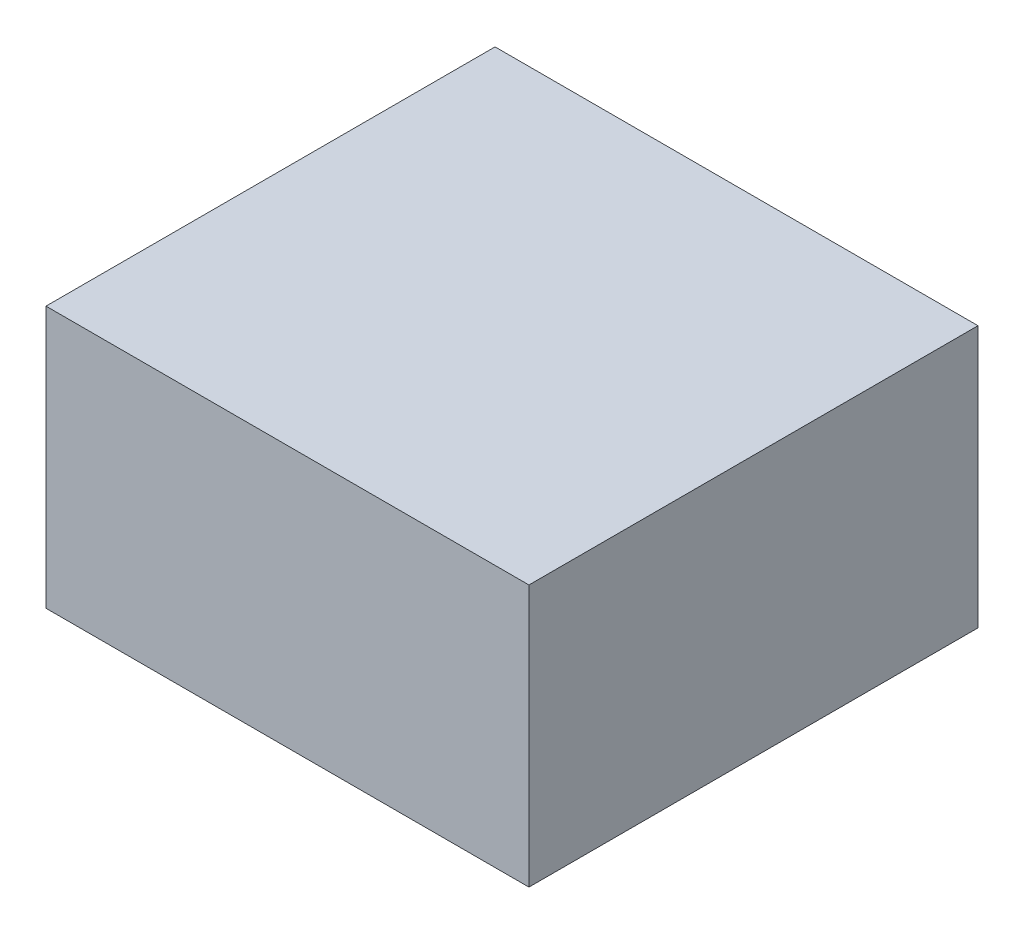
ISO-10303-21;
HEADER;
FILE_DESCRIPTION(('STEP AP214'),'2;1');
FILE_NAME('part.step','',(''),(''),'','','');
FILE_SCHEMA(('AUTOMOTIVE_DESIGN { 1 0 10303 214 1 1 1 1 }'));
ENDSEC;
DATA;
#1=APPLICATION_CONTEXT('core data for automotive mechanical design processes');
#2=APPLICATION_PROTOCOL_DEFINITION('international standard','automotive_design',2000,#1);
#3=PRODUCT_CONTEXT('',#1,'mechanical');
#4=PRODUCT('Part','Part','',(#3));
#5=PRODUCT_RELATED_PRODUCT_CATEGORY('part','',(#4));
#6=PRODUCT_DEFINITION_FORMATION('','',#4);
#7=PRODUCT_DEFINITION_CONTEXT('part definition',#1,'design');
#8=PRODUCT_DEFINITION('design','',#6,#7);
#9=PRODUCT_DEFINITION_SHAPE('','',#8);
#10=(LENGTH_UNIT() NAMED_UNIT(*) SI_UNIT(.MILLI.,.METRE.));
#11=(NAMED_UNIT(*) PLANE_ANGLE_UNIT() SI_UNIT($,.RADIAN.));
#12=(NAMED_UNIT(*) SI_UNIT($,.STERADIAN.) SOLID_ANGLE_UNIT());
#13=UNCERTAINTY_MEASURE_WITH_UNIT(LENGTH_MEASURE(1.E-05),#10,'distance_accuracy_value','');
#14=(GEOMETRIC_REPRESENTATION_CONTEXT(3) GLOBAL_UNCERTAINTY_ASSIGNED_CONTEXT((#13)) GLOBAL_UNIT_ASSIGNED_CONTEXT((#10,
#11,#12)) REPRESENTATION_CONTEXT('',''));
#15=CARTESIAN_POINT('',(0.,0.,0.));
#16=DIRECTION('',(0.,0.,1.));
#17=DIRECTION('',(1.,0.,0.));
#18=AXIS2_PLACEMENT_3D('',#15,#16,#17);
#19=CARTESIAN_POINT('',(0.,55.88,0.));
#20=DIRECTION('',(1.,0.,0.));
#21=DIRECTION('',(0.,0.,-1.));
#22=AXIS2_PLACEMENT_3D('',#19,#20,#21);
#23=PLANE('',#22);
#24=DIRECTION('',(0.,0.,1.));
#25=VECTOR('',#24,1.);
#26=CARTESIAN_POINT('',(0.,0.,0.));
#27=LINE('',#26,#25);
#28=CARTESIAN_POINT('',(0.,0.,0.));
#29=VERTEX_POINT('',#28);
#30=CARTESIAN_POINT('',(0.,0.,95.885));
#31=VERTEX_POINT('',#30);
#32=EDGE_CURVE('E75',#29,#31,#27,.T.);
#33=ORIENTED_EDGE('',*,*,#32,.T.);
#34=DIRECTION('',(0.,-1.,0.));
#35=VECTOR('',#34,1.);
#36=CARTESIAN_POINT('',(0.,55.88,95.885));
#37=LINE('',#36,#35);
#38=CARTESIAN_POINT('',(0.,55.88,95.885));
#39=VERTEX_POINT('',#38);
#40=EDGE_CURVE('E11',#39,#31,#37,.T.);
#41=ORIENTED_EDGE('',*,*,#40,.F.);
#42=DIRECTION('',(0.,0.,1.));
#43=VECTOR('',#42,1.);
#44=CARTESIAN_POINT('',(0.,55.88,0.));
#45=LINE('',#44,#43);
#46=CARTESIAN_POINT('',(0.,55.88,0.));
#47=VERTEX_POINT('',#46);
#48=EDGE_CURVE('E93',#47,#39,#45,.T.);
#49=ORIENTED_EDGE('',*,*,#48,.F.);
#50=DIRECTION('',(0.,-1.,0.));
#51=VECTOR('',#50,1.);
#52=CARTESIAN_POINT('',(0.,55.88,0.));
#53=LINE('',#52,#51);
#54=EDGE_CURVE('E87',#47,#29,#53,.T.);
#55=ORIENTED_EDGE('',*,*,#54,.T.);
#56=EDGE_LOOP('',(#33,#41,#49,#55));
#57=FACE_BOUND('',#56,.T.);
#58=ADVANCED_FACE('F31',(#57),#23,.F.);
#59=CARTESIAN_POINT('',(0.,55.88,95.885));
#60=DIRECTION('',(0.,0.,-1.));
#61=DIRECTION('',(-1.,0.,0.));
#62=AXIS2_PLACEMENT_3D('',#59,#60,#61);
#63=PLANE('',#62);
#64=DIRECTION('',(1.,0.,0.));
#65=VECTOR('',#64,1.);
#66=CARTESIAN_POINT('',(0.,0.,95.885));
#67=LINE('',#66,#65);
#68=CARTESIAN_POINT('',(103.124,0.,95.885));
#69=VERTEX_POINT('',#68);
#70=EDGE_CURVE('E71',#31,#69,#67,.T.);
#71=ORIENTED_EDGE('',*,*,#70,.T.);
#72=DIRECTION('',(0.,-1.,0.));
#73=VECTOR('',#72,1.);
#74=CARTESIAN_POINT('',(103.124,55.88,95.885));
#75=LINE('',#74,#73);
#76=CARTESIAN_POINT('',(103.124,55.88,95.885));
#77=VERTEX_POINT('',#76);
#78=EDGE_CURVE('E38',#77,#69,#75,.T.);
#79=ORIENTED_EDGE('',*,*,#78,.F.);
#80=DIRECTION('',(1.,0.,0.));
#81=VECTOR('',#80,1.);
#82=CARTESIAN_POINT('',(0.,55.88,95.885));
#83=LINE('',#82,#81);
#84=EDGE_CURVE('E83',#39,#77,#83,.T.);
#85=ORIENTED_EDGE('',*,*,#84,.F.);
#86=ORIENTED_EDGE('',*,*,#40,.T.);
#87=EDGE_LOOP('',(#71,#79,#85,#86));
#88=FACE_BOUND('',#87,.T.);
#89=ADVANCED_FACE('F82',(#88),#63,.F.);
#90=CARTESIAN_POINT('',(103.124,55.88,0.));
#91=DIRECTION('',(-1.,0.,0.));
#92=DIRECTION('',(0.,0.,1.));
#93=AXIS2_PLACEMENT_3D('',#90,#91,#92);
#94=PLANE('',#93);
#95=DIRECTION('',(0.,0.,-1.));
#96=VECTOR('',#95,1.);
#97=CARTESIAN_POINT('',(103.124,0.,0.));
#98=LINE('',#97,#96);
#99=CARTESIAN_POINT('',(103.124,0.,0.));
#100=VERTEX_POINT('',#99);
#101=EDGE_CURVE('E76',#69,#100,#98,.T.);
#102=ORIENTED_EDGE('',*,*,#101,.T.);
#103=DIRECTION('',(0.,-1.,0.));
#104=VECTOR('',#103,1.);
#105=CARTESIAN_POINT('',(103.124,55.88,0.));
#106=LINE('',#105,#104);
#107=CARTESIAN_POINT('',(103.124,55.88,0.));
#108=VERTEX_POINT('',#107);
#109=EDGE_CURVE('E99',#108,#100,#106,.T.);
#110=ORIENTED_EDGE('',*,*,#109,.F.);
#111=DIRECTION('',(0.,0.,-1.));
#112=VECTOR('',#111,1.);
#113=CARTESIAN_POINT('',(103.124,55.88,0.));
#114=LINE('',#113,#112);
#115=EDGE_CURVE('E50',#77,#108,#114,.T.);
#116=ORIENTED_EDGE('',*,*,#115,.F.);
#117=ORIENTED_EDGE('',*,*,#78,.T.);
#118=EDGE_LOOP('',(#102,#110,#116,#117));
#119=FACE_BOUND('',#118,.T.);
#120=ADVANCED_FACE('F102',(#119),#94,.F.);
#121=CARTESIAN_POINT('',(0.,55.88,0.));
#122=DIRECTION('',(0.,0.,1.));
#123=DIRECTION('',(1.,0.,0.));
#124=AXIS2_PLACEMENT_3D('',#121,#122,#123);
#125=PLANE('',#124);
#126=DIRECTION('',(-1.,0.,0.));
#127=VECTOR('',#126,1.);
#128=CARTESIAN_POINT('',(0.,0.,0.));
#129=LINE('',#128,#127);
#130=EDGE_CURVE('E91',#100,#29,#129,.T.);
#131=ORIENTED_EDGE('',*,*,#130,.T.);
#132=ORIENTED_EDGE('',*,*,#54,.F.);
#133=DIRECTION('',(-1.,0.,0.));
#134=VECTOR('',#133,1.);
#135=CARTESIAN_POINT('',(0.,55.88,0.));
#136=LINE('',#135,#134);
#137=EDGE_CURVE('E45',#108,#47,#136,.T.);
#138=ORIENTED_EDGE('',*,*,#137,.F.);
#139=ORIENTED_EDGE('',*,*,#109,.T.);
#140=EDGE_LOOP('',(#131,#132,#138,#139));
#141=FACE_BOUND('',#140,.T.);
#142=ADVANCED_FACE('F104',(#141),#125,.F.);
#143=CARTESIAN_POINT('',(0.,55.88,95.885));
#144=DIRECTION('',(0.,1.,0.));
#145=DIRECTION('',(0.,0.,1.));
#146=AXIS2_PLACEMENT_3D('',#143,#144,#145);
#147=PLANE('',#146);
#148=ORIENTED_EDGE('',*,*,#48,.T.);
#149=ORIENTED_EDGE('',*,*,#84,.T.);
#150=ORIENTED_EDGE('',*,*,#115,.T.);
#151=ORIENTED_EDGE('',*,*,#137,.T.);
#152=EDGE_LOOP('',(#148,#149,#150,#151));
#153=FACE_BOUND('',#152,.T.);
#154=ADVANCED_FACE('F105',(#153),#147,.T.);
#155=CARTESIAN_POINT('',(0.,0.,95.885));
#156=DIRECTION('',(0.,1.,0.));
#157=DIRECTION('',(0.,0.,1.));
#158=AXIS2_PLACEMENT_3D('',#155,#156,#157);
#159=PLANE('',#158);
#160=ORIENTED_EDGE('',*,*,#32,.F.);
#161=ORIENTED_EDGE('',*,*,#130,.F.);
#162=ORIENTED_EDGE('',*,*,#101,.F.);
#163=ORIENTED_EDGE('',*,*,#70,.F.);
#164=EDGE_LOOP('',(#160,#161,#162,#163));
#165=FACE_BOUND('',#164,.T.);
#166=ADVANCED_FACE('F72',(#165),#159,.F.);
#167=CLOSED_SHELL('',(#58,#89,#120,#142,#154,#166));
#168=MANIFOLD_SOLID_BREP('B2',#167);
#169=ADVANCED_BREP_SHAPE_REPRESENTATION('',(#18,#168),#14);
#170=SHAPE_DEFINITION_REPRESENTATION(#9,#169);
ENDSEC;
END-ISO-10303-21;
